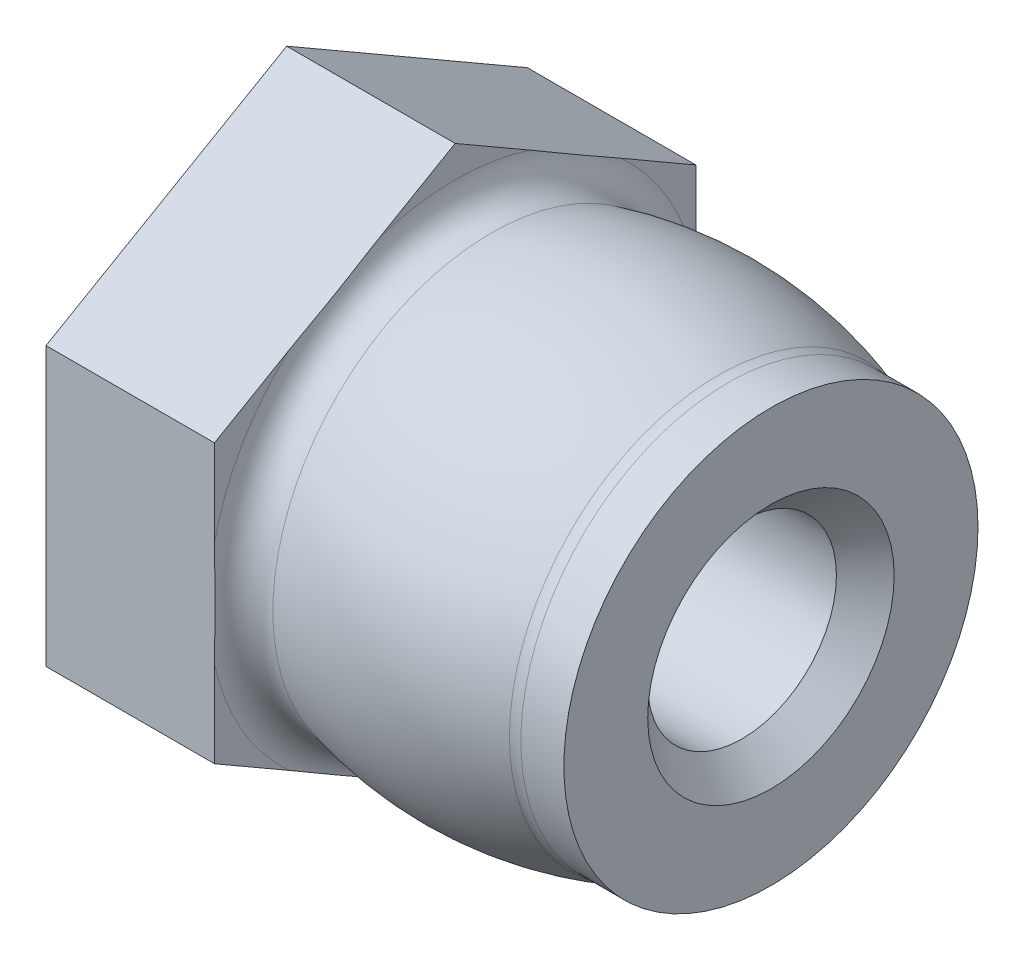
ISO-10303-21;
HEADER;
FILE_DESCRIPTION(('STEP AP214'),'2;1');
FILE_NAME('part.step','',(''),(''),'','','');
FILE_SCHEMA(('AUTOMOTIVE_DESIGN { 1 0 10303 214 1 1 1 1 }'));
ENDSEC;
DATA;
#1=APPLICATION_CONTEXT('core data for automotive mechanical design processes');
#2=APPLICATION_PROTOCOL_DEFINITION('international standard','automotive_design',2000,#1);
#3=PRODUCT_CONTEXT('',#1,'mechanical');
#4=PRODUCT('Part','Part','',(#3));
#5=PRODUCT_RELATED_PRODUCT_CATEGORY('part','',(#4));
#6=PRODUCT_DEFINITION_FORMATION('','',#4);
#7=PRODUCT_DEFINITION_CONTEXT('part definition',#1,'design');
#8=PRODUCT_DEFINITION('design','',#6,#7);
#9=PRODUCT_DEFINITION_SHAPE('','',#8);
#10=(LENGTH_UNIT() NAMED_UNIT(*) SI_UNIT(.MILLI.,.METRE.));
#11=(NAMED_UNIT(*) PLANE_ANGLE_UNIT() SI_UNIT($,.RADIAN.));
#12=(NAMED_UNIT(*) SI_UNIT($,.STERADIAN.) SOLID_ANGLE_UNIT());
#13=UNCERTAINTY_MEASURE_WITH_UNIT(LENGTH_MEASURE(1.E-05),#10,'distance_accuracy_value','');
#14=(GEOMETRIC_REPRESENTATION_CONTEXT(3) GLOBAL_UNCERTAINTY_ASSIGNED_CONTEXT((#13)) GLOBAL_UNIT_ASSIGNED_CONTEXT((#10,
#11,#12)) REPRESENTATION_CONTEXT('',''));
#15=CARTESIAN_POINT('',(0.,0.,0.));
#16=DIRECTION('',(0.,0.,1.));
#17=DIRECTION('',(1.,0.,0.));
#18=AXIS2_PLACEMENT_3D('',#15,#16,#17);
#19=CARTESIAN_POINT('',(-3.14960000000001,0.,0.));
#20=DIRECTION('',(-1.,0.,0.));
#21=DIRECTION('',(0.,0.,1.));
#22=AXIS2_PLACEMENT_3D('',#19,#20,#21);
#23=TOROIDAL_SURFACE('',#22,3.25060987392028,0.381);
#24=CARTESIAN_POINT('',(-3.05302093023256,0.,0.));
#25=DIRECTION('',(1.,0.,0.));
#26=DIRECTION('',(0.,0.,-1.));
#27=AXIS2_PLACEMENT_3D('',#24,#25,#26);
#28=CIRCLE('',#27,2.88205393070018);
#29=CARTESIAN_POINT('',(-3.05302093023256,0.,-2.88205393070018));
#30=VERTEX_POINT('',#29);
#31=EDGE_CURVE('E189',#30,#30,#28,.T.);
#32=ORIENTED_EDGE('',*,*,#31,.F.);
#33=EDGE_LOOP('',(#32));
#34=FACE_BOUND('',#33,.T.);
#35=CARTESIAN_POINT('',(-3.53060000000001,-2.40111969864125,-2.19113868689888));
#36=CARTESIAN_POINT('',(-3.53059778248931,-2.41699539462289,-2.16364117485317));
#37=CARTESIAN_POINT('',(-3.53041782991021,-2.43287055074597,-2.13614459786991));
#38=CARTESIAN_POINT('',(-3.5298255789991,-2.46461936001962,-2.08115404712812));
#39=CARTESIAN_POINT('',(-3.52941328790421,-2.48049301320161,-2.05366007331518));
#40=CARTESIAN_POINT('',(-3.52801246219747,-2.52811586969751,-1.97117486626273));
#41=CARTESIAN_POINT('',(-3.52686002685498,-2.55986366672469,-1.91618606878327));
#42=CARTESIAN_POINT('',(-3.52485740280003,-2.62336235971134,-1.80620310631617));
#43=CARTESIAN_POINT('',(-3.52400721741701,-2.65511325570111,-1.75120894127607));
#44=CARTESIAN_POINT('',(-3.52302462226493,-2.71861636116313,-1.64121833617744));
#45=CARTESIAN_POINT('',(-3.52289216601668,-2.75036857041717,-1.58622189649688));
#46=CARTESIAN_POINT('',(-3.52350562407884,-2.82413679875055,-1.45845157703912));
#47=CARTESIAN_POINT('',(-3.52454938556569,-2.86615200576856,-1.38567910379341));
#48=CARTESIAN_POINT('',(-3.52720055638054,-2.95017441594571,-1.2401480203922));
#49=CARTESIAN_POINT('',(-3.52880793044301,-2.99218161944112,-1.16738940965425));
#50=CARTESIAN_POINT('',(-3.53026428704555,-3.05521473082886,-1.05821285817154));
#51=CARTESIAN_POINT('',(-3.53059056765064,-3.07623699516409,-1.02180122825278));
#52=CARTESIAN_POINT('',(-3.53060905622116,-3.11827879067396,-0.948982702388267));
#53=CARTESIAN_POINT('',(-3.53030136303735,-3.13929832176372,-0.912575806589532));
#54=CARTESIAN_POINT('',(-3.52870070507489,-3.18134771155148,-0.839744127049862));
#55=CARTESIAN_POINT('',(-3.52740694120278,-3.20237756479438,-0.803319352757446));
#56=CARTESIAN_POINT('',(-3.52338294774461,-3.24441366518432,-0.73051069113));
#57=CARTESIAN_POINT('',(-3.52065189611206,-3.26541989192108,-0.694126839146607));
#58=CARTESIAN_POINT('',(-3.5169774328567,-3.28639380282328,-0.657798959830585));
#59=B_SPLINE_CURVE_WITH_KNOTS('',3,(#35,#36,#37,#38,#39,#40,#41,#42,#43,#44,#45,#46,#47,#48,#49,
#50,#51,#52,#53,#54,#55,#56,#57,#58),.UNSPECIFIED.,.F.,.F.,(4,2,2,2,2,2,2,2,2,2,2,4),(0.,
0.0952522088142865,0.190501450772941,0.38101975387857,0.571540155581727,0.762048219287196,
1.01415253280483,1.26624107484074,1.39237544496322,1.51849014939091,1.64470716365326,
1.77099644541574),.UNSPECIFIED.);
#60=CARTESIAN_POINT('',(-3.53060000000001,-2.40111969864125,-2.19113868689888));
#61=VERTEX_POINT('',#60);
#62=CARTESIAN_POINT('',(-3.53060000000001,-3.09814161538993,-0.983861313101117));
#63=VERTEX_POINT('',#62);
#64=EDGE_CURVE('E245',#61,#63,#59,.T.);
#65=ORIENTED_EDGE('',*,*,#64,.F.);
#66=CARTESIAN_POINT('',(-3.53060000000001,0.,0.));
#67=DIRECTION('',(-1.,0.,0.));
#68=DIRECTION('',(0.,0.,1.));
#69=AXIS2_PLACEMENT_3D('',#66,#67,#68);
#70=CIRCLE('',#69,3.25060987392028);
#71=CARTESIAN_POINT('',(-3.53060000000001,-0.697021916748682,-3.175));
#72=VERTEX_POINT('',#71);
#73=EDGE_CURVE('E173',#72,#61,#70,.T.);
#74=ORIENTED_EDGE('',*,*,#73,.F.);
#75=CARTESIAN_POINT('',(-3.53060000000001,0.697021916748679,-3.175));
#76=CARTESIAN_POINT('',(-3.53059778248931,0.665270524785404,-3.175));
#77=CARTESIAN_POINT('',(-3.53041782991021,0.63352021253925,-3.175));
#78=CARTESIAN_POINT('',(-3.5298255789991,0.570022593991937,-3.175));
#79=CARTESIAN_POINT('',(-3.52941328790421,0.538275287627952,-3.175));
#80=CARTESIAN_POINT('',(-3.52801246219747,0.443029574636154,-3.175));
#81=CARTESIAN_POINT('',(-3.52686002685498,0.379533980581803,-3.175));
#82=CARTESIAN_POINT('',(-3.52485740280003,0.252536594608494,-3.175));
#83=CARTESIAN_POINT('',(-3.52400721741701,0.18903480262897,-3.175));
#84=CARTESIAN_POINT('',(-3.52302462226493,0.0620285917049256,-3.175));
#85=CARTESIAN_POINT('',(-3.52289216601668,-0.00147582680316025,-3.175));
#86=CARTESIAN_POINT('',(-3.52350562407884,-0.149012283469925,-3.175));
#87=CARTESIAN_POINT('',(-3.52454938556569,-0.233042697505939,-3.175));
#88=CARTESIAN_POINT('',(-3.52720055638054,-0.401087517860226,-3.175));
#89=CARTESIAN_POINT('',(-3.52880793044301,-0.485101924851065,-3.175));
#90=CARTESIAN_POINT('',(-3.53026428704555,-0.611168147626539,-3.175));
#91=CARTESIAN_POINT('',(-3.53059056765064,-0.653212676296992,-3.175));
#92=CARTESIAN_POINT('',(-3.53060905622116,-0.737296267316729,-3.175));
#93=CARTESIAN_POINT('',(-3.53030136303735,-0.779335329496246,-3.175));
#94=CARTESIAN_POINT('',(-3.52870070507489,-0.863434109071766,-3.175));
#95=CARTESIAN_POINT('',(-3.52740694120278,-0.905493815557562,-3.175));
#96=CARTESIAN_POINT('',(-3.52338294774461,-0.989566016337445,-3.175));
#97=CARTESIAN_POINT('',(-3.52065189611206,-1.03157846981098,-3.175));
#98=CARTESIAN_POINT('',(-3.5169774328567,-1.07352629161537,-3.175));
#99=B_SPLINE_CURVE_WITH_KNOTS('',3,(#75,#76,#77,#78,#79,#80,#81,#82,#83,#84,#85,#86,#87,#88,#89,
#90,#91,#92,#93,#94,#95,#96,#97,#98),.UNSPECIFIED.,.F.,.F.,(4,2,2,2,2,2,2,2,2,2,2,4),(0.,
0.0952522088142865,0.190501450772942,0.38101975387857,0.571540155581726,0.762048219287195,
1.01415253280483,1.26624107484073,1.39237544496321,1.5184901493909,1.64470716365325,
1.77099644541573),.UNSPECIFIED.);
#100=CARTESIAN_POINT('',(-3.53060000000001,0.697021916748679,-3.175));
#101=VERTEX_POINT('',#100);
#102=EDGE_CURVE('E47',#101,#72,#99,.T.);
#103=ORIENTED_EDGE('',*,*,#102,.F.);
#104=CARTESIAN_POINT('',(-3.53060000000001,0.,0.));
#105=DIRECTION('',(-1.,0.,0.));
#106=DIRECTION('',(0.,0.,1.));
#107=AXIS2_PLACEMENT_3D('',#104,#105,#106);
#108=CIRCLE('',#107,3.25060987392028);
#109=CARTESIAN_POINT('',(-3.53060000000001,2.40111969864125,-2.19113868689888));
#110=VERTEX_POINT('',#109);
#111=EDGE_CURVE('E124',#110,#101,#108,.T.);
#112=ORIENTED_EDGE('',*,*,#111,.F.);
#113=CARTESIAN_POINT('',(-3.53060000000001,3.09814161538993,-0.983861313101122));
#114=CARTESIAN_POINT('',(-3.53059778248931,3.08226591940829,-1.01135882514684));
#115=CARTESIAN_POINT('',(-3.53041782991021,3.06639076328522,-1.03885540213009));
#116=CARTESIAN_POINT('',(-3.5298255789991,3.03464195401156,-1.09384595287188));
#117=CARTESIAN_POINT('',(-3.52941328790421,3.01876830082957,-1.12133992668482));
#118=CARTESIAN_POINT('',(-3.52801246219747,2.97114544433367,-1.20382513373728));
#119=CARTESIAN_POINT('',(-3.52686002685498,2.93939764730649,-1.25881393121673));
#120=CARTESIAN_POINT('',(-3.52485740280003,2.87589895431984,-1.36879689368383));
#121=CARTESIAN_POINT('',(-3.52400721741701,2.84414805833008,-1.42379105872394));
#122=CARTESIAN_POINT('',(-3.52302462226493,2.78064495286806,-1.53378166382256));
#123=CARTESIAN_POINT('',(-3.52289216601668,2.74889274361401,-1.58877810350312));
#124=CARTESIAN_POINT('',(-3.52350562407884,2.67512451528063,-1.71654842296088));
#125=CARTESIAN_POINT('',(-3.52454938556569,2.63310930826262,-1.7893208962066));
#126=CARTESIAN_POINT('',(-3.52720055638054,2.54908689808548,-1.9348519796078));
#127=CARTESIAN_POINT('',(-3.52880793044301,2.50707969459006,-2.00761059034575));
#128=CARTESIAN_POINT('',(-3.53026428704555,2.44404658320233,-2.11678714182846));
#129=CARTESIAN_POINT('',(-3.53059056765064,2.4230243188671,-2.15319877174721));
#130=CARTESIAN_POINT('',(-3.53060905622116,2.38098252335723,-2.22601729761172));
#131=CARTESIAN_POINT('',(-3.53030136303735,2.35996299226747,-2.26242419341046));
#132=CARTESIAN_POINT('',(-3.52870070507489,2.31791360247971,-2.33525587295013));
#133=CARTESIAN_POINT('',(-3.52740694120278,2.29688374923682,-2.37168064724254));
#134=CARTESIAN_POINT('',(-3.52338294774461,2.25484764884687,-2.44448930886999));
#135=CARTESIAN_POINT('',(-3.52065189611206,2.23384142211011,-2.48087316085338));
#136=CARTESIAN_POINT('',(-3.5169774328567,2.21286751120791,-2.5172010401694));
#137=B_SPLINE_CURVE_WITH_KNOTS('',3,(#113,#114,#115,#116,#117,#118,#119,#120,#121,#122,#123,
#124,#125,#126,#127,#128,#129,#130,#131,#132,#133,#134,#135,#136),.UNSPECIFIED.,.F.,.F.,(4,2,2,
2,2,2,2,2,2,2,2,4),(0.,0.0952522088142867,0.190501450772942,0.381019753878571,0.571540155581727,
0.762048219287196,1.01415253280482,1.26624107484073,1.39237544496321,1.5184901493909,
1.64470716365324,1.77099644541572),.UNSPECIFIED.);
#138=CARTESIAN_POINT('',(-3.53060000000001,3.09814161538993,-0.983861313101122));
#139=VERTEX_POINT('',#138);
#140=EDGE_CURVE('E136',#139,#110,#137,.T.);
#141=ORIENTED_EDGE('',*,*,#140,.F.);
#142=CARTESIAN_POINT('',(-3.53060000000001,0.,0.));
#143=DIRECTION('',(-1.,0.,0.));
#144=DIRECTION('',(0.,0.,1.));
#145=AXIS2_PLACEMENT_3D('',#142,#143,#144);
#146=CIRCLE('',#145,3.25060987392028);
#147=CARTESIAN_POINT('',(-3.53060000000001,3.09814161538993,0.983861313101121));
#148=VERTEX_POINT('',#147);
#149=EDGE_CURVE('E177',#148,#139,#146,.T.);
#150=ORIENTED_EDGE('',*,*,#149,.F.);
#151=CARTESIAN_POINT('',(-3.53060000000001,2.40111969864125,2.19113868689888));
#152=CARTESIAN_POINT('',(-3.53059778248931,2.41699539462289,2.16364117485316));
#153=CARTESIAN_POINT('',(-3.53041782991021,2.43287055074597,2.13614459786991));
#154=CARTESIAN_POINT('',(-3.5298255789991,2.46461936001962,2.08115404712812));
#155=CARTESIAN_POINT('',(-3.52941328790421,2.48049301320162,2.05366007331518));
#156=CARTESIAN_POINT('',(-3.52801246219747,2.52811586969752,1.97117486626272));
#157=CARTESIAN_POINT('',(-3.52686002685498,2.55986366672469,1.91618606878327));
#158=CARTESIAN_POINT('',(-3.52485740280003,2.62336235971135,1.80620310631617));
#159=CARTESIAN_POINT('',(-3.52400721741701,2.65511325570111,1.75120894127606));
#160=CARTESIAN_POINT('',(-3.52302462226493,2.71861636116313,1.64121833617744));
#161=CARTESIAN_POINT('',(-3.52289216601668,2.75036857041717,1.58622189649688));
#162=CARTESIAN_POINT('',(-3.52350562407884,2.82413679875055,1.45845157703912));
#163=CARTESIAN_POINT('',(-3.52454938556569,2.86615200576856,1.3856791037934));
#164=CARTESIAN_POINT('',(-3.52720055638054,2.9501744159457,1.2401480203922));
#165=CARTESIAN_POINT('',(-3.52880793044301,2.99218161944112,1.16738940965425));
#166=CARTESIAN_POINT('',(-3.53026428704555,3.05521473082886,1.05821285817154));
#167=CARTESIAN_POINT('',(-3.53059056765064,3.07623699516409,1.02180122825279));
#168=CARTESIAN_POINT('',(-3.53060905622116,3.11827879067395,0.948982702388274));
#169=CARTESIAN_POINT('',(-3.53030136303735,3.13929832176371,0.912575806589539));
#170=CARTESIAN_POINT('',(-3.52870070507489,3.18134771155147,0.83974412704987));
#171=CARTESIAN_POINT('',(-3.52740694120278,3.20237756479437,0.803319352757454));
#172=CARTESIAN_POINT('',(-3.52338294774461,3.24441366518431,0.73051069113001));
#173=CARTESIAN_POINT('',(-3.52065189611206,3.26541989192108,0.694126839146617));
#174=CARTESIAN_POINT('',(-3.5169774328567,3.28639380282327,0.657798959830596));
#175=B_SPLINE_CURVE_WITH_KNOTS('',3,(#151,#152,#153,#154,#155,#156,#157,#158,#159,#160,#161,
#162,#163,#164,#165,#166,#167,#168,#169,#170,#171,#172,#173,#174),.UNSPECIFIED.,.F.,.F.,(4,2,2,
2,2,2,2,2,2,2,2,4),(0.,0.0952522088142865,0.190501450772942,0.38101975387857,0.571540155581727,
0.762048219287196,1.01415253280483,1.26624107484073,1.39237544496321,1.5184901493909,
1.64470716365325,1.77099644541572),.UNSPECIFIED.);
#176=CARTESIAN_POINT('',(-3.53060000000001,2.40111969864125,2.19113868689888));
#177=VERTEX_POINT('',#176);
#178=EDGE_CURVE('E229',#177,#148,#175,.T.);
#179=ORIENTED_EDGE('',*,*,#178,.F.);
#180=CARTESIAN_POINT('',(-3.53060000000001,0.,0.));
#181=DIRECTION('',(-1.,0.,0.));
#182=DIRECTION('',(0.,0.,1.));
#183=AXIS2_PLACEMENT_3D('',#180,#181,#182);
#184=CIRCLE('',#183,3.25060987392028);
#185=CARTESIAN_POINT('',(-3.53060000000001,0.697021916748691,3.175));
#186=VERTEX_POINT('',#185);
#187=EDGE_CURVE('E180',#186,#177,#184,.T.);
#188=ORIENTED_EDGE('',*,*,#187,.F.);
#189=CARTESIAN_POINT('',(-3.53060000000001,-0.697021916748688,3.175));
#190=CARTESIAN_POINT('',(-3.53059778248931,-0.665270524785412,3.175));
#191=CARTESIAN_POINT('',(-3.53041782991021,-0.633520212539258,3.175));
#192=CARTESIAN_POINT('',(-3.5298255789991,-0.570022593991945,3.175));
#193=CARTESIAN_POINT('',(-3.52941328790421,-0.538275287627961,3.175));
#194=CARTESIAN_POINT('',(-3.52801246219747,-0.443029574636163,3.175));
#195=CARTESIAN_POINT('',(-3.52686002685498,-0.379533980581812,3.175));
#196=CARTESIAN_POINT('',(-3.52485740280003,-0.252536594608503,3.175));
#197=CARTESIAN_POINT('',(-3.52400721741701,-0.189034802628978,3.175));
#198=CARTESIAN_POINT('',(-3.52302462226493,-0.0620285917049341,3.175));
#199=CARTESIAN_POINT('',(-3.52289216601668,0.00147582680315178,3.175));
#200=CARTESIAN_POINT('',(-3.52350562407884,0.14901228346992,3.175));
#201=CARTESIAN_POINT('',(-3.52454938556569,0.233042697505937,3.175));
#202=CARTESIAN_POINT('',(-3.52720055638054,0.40108751786023,3.175));
#203=CARTESIAN_POINT('',(-3.52880793044301,0.485101924851071,3.175));
#204=CARTESIAN_POINT('',(-3.53026428704555,0.61116814762655,3.175));
#205=CARTESIAN_POINT('',(-3.53059056765064,0.653212676297005,3.175));
#206=CARTESIAN_POINT('',(-3.53060905622116,0.737296267316744,3.175));
#207=CARTESIAN_POINT('',(-3.53030136303735,0.779335329496263,3.175));
#208=CARTESIAN_POINT('',(-3.52870070507489,0.863434109071786,3.175));
#209=CARTESIAN_POINT('',(-3.52740694120278,0.905493815557584,3.175));
#210=CARTESIAN_POINT('',(-3.5233829477446,0.98956601633747,3.175));
#211=CARTESIAN_POINT('',(-3.52065189611205,1.03157846981101,3.175));
#212=CARTESIAN_POINT('',(-3.5169774328567,1.07352629161539,3.175));
#213=B_SPLINE_CURVE_WITH_KNOTS('',3,(#189,#190,#191,#192,#193,#194,#195,#196,#197,#198,#199,
#200,#201,#202,#203,#204,#205,#206,#207,#208,#209,#210,#211,#212),.UNSPECIFIED.,.F.,.F.,(4,2,2,
2,2,2,2,2,2,2,2,4),(0.,0.0952522088142865,0.190501450772942,0.38101975387857,0.571540155581726,
0.762048219287195,1.01415253280484,1.26624107484075,1.39237544496323,1.51849014939093,
1.64470716365329,1.77099644541576),.UNSPECIFIED.);
#214=CARTESIAN_POINT('',(-3.53060000000001,-0.697021916748688,3.175));
#215=VERTEX_POINT('',#214);
#216=EDGE_CURVE('E200',#215,#186,#213,.T.);
#217=ORIENTED_EDGE('',*,*,#216,.F.);
#218=CARTESIAN_POINT('',(-3.53060000000001,0.,0.));
#219=DIRECTION('',(-1.,0.,0.));
#220=DIRECTION('',(0.,0.,1.));
#221=AXIS2_PLACEMENT_3D('',#218,#219,#220);
#222=CIRCLE('',#221,3.25060987392028);
#223=CARTESIAN_POINT('',(-3.53060000000001,-2.40111969864125,2.19113868689888));
#224=VERTEX_POINT('',#223);
#225=EDGE_CURVE('E183',#224,#215,#222,.T.);
#226=ORIENTED_EDGE('',*,*,#225,.F.);
#227=CARTESIAN_POINT('',(-3.53060000000001,-3.09814161538993,0.98386131310112));
#228=CARTESIAN_POINT('',(-3.53059778248931,-3.0822659194083,1.01135882514683));
#229=CARTESIAN_POINT('',(-3.53041782991021,-3.06639076328522,1.03885540213009));
#230=CARTESIAN_POINT('',(-3.5298255789991,-3.03464195401156,1.09384595287188));
#231=CARTESIAN_POINT('',(-3.52941328790421,-3.01876830082957,1.12133992668482));
#232=CARTESIAN_POINT('',(-3.52801246219747,-2.97114544433367,1.20382513373727));
#233=CARTESIAN_POINT('',(-3.52686002685498,-2.9393976473065,1.25881393121673));
#234=CARTESIAN_POINT('',(-3.52485740280003,-2.87589895431984,1.36879689368383));
#235=CARTESIAN_POINT('',(-3.52400721741701,-2.84414805833008,1.42379105872393));
#236=CARTESIAN_POINT('',(-3.52302462226493,-2.78064495286806,1.53378166382256));
#237=CARTESIAN_POINT('',(-3.52289216601668,-2.74889274361401,1.58877810350312));
#238=CARTESIAN_POINT('',(-3.52350562407884,-2.67512451528063,1.71654842296088));
#239=CARTESIAN_POINT('',(-3.52454938556569,-2.63310930826262,1.78932089620659));
#240=CARTESIAN_POINT('',(-3.52720055638054,-2.54908689808548,1.9348519796078));
#241=CARTESIAN_POINT('',(-3.52880793044301,-2.50707969459006,2.00761059034575));
#242=CARTESIAN_POINT('',(-3.53026428704555,-2.44404658320232,2.11678714182846));
#243=CARTESIAN_POINT('',(-3.53059056765064,-2.4230243188671,2.15319877174721));
#244=CARTESIAN_POINT('',(-3.53060905622116,-2.38098252335723,2.22601729761173));
#245=CARTESIAN_POINT('',(-3.53030136303735,-2.35996299226747,2.26242419341046));
#246=CARTESIAN_POINT('',(-3.52870070507489,-2.31791360247971,2.33525587295013));
#247=CARTESIAN_POINT('',(-3.52740694120278,-2.29688374923681,2.37168064724255));
#248=CARTESIAN_POINT('',(-3.52338294774461,-2.25484764884687,2.44448930886999));
#249=CARTESIAN_POINT('',(-3.52065189611206,-2.23384142211011,2.48087316085338));
#250=CARTESIAN_POINT('',(-3.5169774328567,-2.21286751120791,2.51720104016941));
#251=B_SPLINE_CURVE_WITH_KNOTS('',3,(#227,#228,#229,#230,#231,#232,#233,#234,#235,#236,#237,
#238,#239,#240,#241,#242,#243,#244,#245,#246,#247,#248,#249,#250),.UNSPECIFIED.,.F.,.F.,(4,2,2,
2,2,2,2,2,2,2,2,4),(0.,0.0952522088142863,0.190501450772941,0.38101975387857,0.571540155581727,
0.762048219287196,1.01415253280483,1.26624107484073,1.39237544496321,1.5184901493909,
1.64470716365325,1.77099644541572),.UNSPECIFIED.);
#252=CARTESIAN_POINT('',(-3.53060000000001,-3.09814161538993,0.98386131310112));
#253=VERTEX_POINT('',#252);
#254=EDGE_CURVE('E192',#253,#224,#251,.T.);
#255=ORIENTED_EDGE('',*,*,#254,.F.);
#256=CARTESIAN_POINT('',(-3.53060000000001,0.,0.));
#257=DIRECTION('',(-1.,0.,0.));
#258=DIRECTION('',(0.,0.,1.));
#259=AXIS2_PLACEMENT_3D('',#256,#257,#258);
#260=CIRCLE('',#259,3.25060987392028);
#261=EDGE_CURVE('E186',#63,#253,#260,.T.);
#262=ORIENTED_EDGE('',*,*,#261,.F.);
#263=EDGE_LOOP('',(#65,#74,#103,#112,#141,#150,#179,#188,#217,#226,#255,#262));
#264=FACE_BOUND('',#263,.T.);
#265=ADVANCED_FACE('F32',(#34,#264),#23,.F.);
#266=CARTESIAN_POINT('',(-3.53060000000001,3.175,0.));
#267=DIRECTION('',(-1.,0.,0.));
#268=DIRECTION('',(0.,0.,1.));
#269=AXIS2_PLACEMENT_3D('',#266,#267,#268);
#270=PLANE('',#269);
#271=DIRECTION('',(0.,0.5,-0.866025403784439));
#272=VECTOR('',#271,1.);
#273=CARTESIAN_POINT('',(-3.53060000000001,-2.74963065701559,-1.5875));
#274=LINE('',#273,#272);
#275=CARTESIAN_POINT('',(-3.53060000000001,-3.66617420935412,0.));
#276=VERTEX_POINT('',#275);
#277=EDGE_CURVE('E127',#276,#63,#274,.T.);
#278=ORIENTED_EDGE('',*,*,#277,.T.);
#279=ORIENTED_EDGE('',*,*,#261,.T.);
#280=DIRECTION('',(0.,-0.5,-0.866025403784439));
#281=VECTOR('',#280,1.);
#282=CARTESIAN_POINT('',(-3.53060000000001,-2.74963065701559,1.5875));
#283=LINE('',#282,#281);
#284=EDGE_CURVE('E162',#253,#276,#283,.T.);
#285=ORIENTED_EDGE('',*,*,#284,.T.);
#286=EDGE_LOOP('',(#278,#279,#285));
#287=FACE_BOUND('',#286,.T.);
#288=ADVANCED_FACE('F266',(#287),#270,.F.);
#289=CARTESIAN_POINT('',(-3.53060000000001,-1.83308710467706,3.175));
#290=VERTEX_POINT('',#289);
#291=EDGE_CURVE('E163',#290,#224,#283,.T.);
#292=ORIENTED_EDGE('',*,*,#291,.T.);
#293=ORIENTED_EDGE('',*,*,#225,.T.);
#294=DIRECTION('',(0.,-1.,0.));
#295=VECTOR('',#294,1.);
#296=CARTESIAN_POINT('',(-3.53060000000001,0.,3.175));
#297=LINE('',#296,#295);
#298=EDGE_CURVE('E158',#215,#290,#297,.T.);
#299=ORIENTED_EDGE('',*,*,#298,.T.);
#300=EDGE_LOOP('',(#292,#293,#299));
#301=FACE_BOUND('',#300,.T.);
#302=ADVANCED_FACE('F271',(#301),#270,.F.);
#303=CARTESIAN_POINT('',(-3.53060000000001,1.83308710467706,3.175));
#304=VERTEX_POINT('',#303);
#305=EDGE_CURVE('E159',#304,#186,#297,.T.);
#306=ORIENTED_EDGE('',*,*,#305,.T.);
#307=ORIENTED_EDGE('',*,*,#187,.T.);
#308=DIRECTION('',(0.,-0.5,0.866025403784439));
#309=VECTOR('',#308,1.);
#310=CARTESIAN_POINT('',(-3.53060000000001,2.74963065701559,1.5875));
#311=LINE('',#310,#309);
#312=EDGE_CURVE('E137',#177,#304,#311,.T.);
#313=ORIENTED_EDGE('',*,*,#312,.T.);
#314=EDGE_LOOP('',(#306,#307,#313));
#315=FACE_BOUND('',#314,.T.);
#316=ADVANCED_FACE('F323',(#315),#270,.F.);
#317=CARTESIAN_POINT('',(-3.53060000000001,3.66617420935412,0.));
#318=VERTEX_POINT('',#317);
#319=EDGE_CURVE('E155',#318,#148,#311,.T.);
#320=ORIENTED_EDGE('',*,*,#319,.T.);
#321=ORIENTED_EDGE('',*,*,#149,.T.);
#322=DIRECTION('',(0.,0.5,0.866025403784438));
#323=VECTOR('',#322,1.);
#324=CARTESIAN_POINT('',(-3.53060000000001,2.74963065701559,-1.5875));
#325=LINE('',#324,#323);
#326=EDGE_CURVE('E138',#139,#318,#325,.T.);
#327=ORIENTED_EDGE('',*,*,#326,.T.);
#328=EDGE_LOOP('',(#320,#321,#327));
#329=FACE_BOUND('',#328,.T.);
#330=ADVANCED_FACE('F307',(#329),#270,.F.);
#331=CARTESIAN_POINT('',(-3.53060000000001,1.83308710467706,-3.175));
#332=VERTEX_POINT('',#331);
#333=EDGE_CURVE('E123',#332,#110,#325,.T.);
#334=ORIENTED_EDGE('',*,*,#333,.T.);
#335=ORIENTED_EDGE('',*,*,#111,.T.);
#336=DIRECTION('',(0.,1.,0.));
#337=VECTOR('',#336,1.);
#338=CARTESIAN_POINT('',(-3.53060000000001,0.,-3.175));
#339=LINE('',#338,#337);
#340=EDGE_CURVE('E120',#101,#332,#339,.T.);
#341=ORIENTED_EDGE('',*,*,#340,.T.);
#342=EDGE_LOOP('',(#334,#335,#341));
#343=FACE_BOUND('',#342,.T.);
#344=ADVANCED_FACE('F122',(#343),#270,.F.);
#345=CARTESIAN_POINT('',(-1.7653,0.,0.));
#346=DIRECTION('',(-1.,0.,0.));
#347=DIRECTION('',(0.,0.,1.));
#348=AXIS2_PLACEMENT_3D('',#345,#346,#347);
#349=DEGENERATE_TOROIDAL_SURFACE('',#348,2.03202531223445,5.08,.F.);
#350=CARTESIAN_POINT('',(-0.0607843458594306,0.,0.));
#351=DIRECTION('',(-1.,0.,0.));
#352=DIRECTION('',(0.,0.,1.));
#353=AXIS2_PLACEMENT_3D('',#350,#351,#352);
#354=CIRCLE('',#353,2.75347637356504);
#355=CARTESIAN_POINT('',(-0.0607843458594306,0.,2.75347637356504));
#356=VERTEX_POINT('',#355);
#357=EDGE_CURVE('E346',#356,#356,#354,.T.);
#358=ORIENTED_EDGE('',*,*,#357,.T.);
#359=EDGE_LOOP('',(#358));
#360=FACE_BOUND('',#359,.T.);
#361=ORIENTED_EDGE('',*,*,#31,.T.);
#362=EDGE_LOOP('',(#361));
#363=FACE_BOUND('',#362,.T.);
#364=ADVANCED_FACE('F336',(#360,#363),#349,.F.);
#365=CARTESIAN_POINT('',(-40.930080616584,0.,0.));
#366=DIRECTION('',(-1.,0.,0.));
#367=DIRECTION('',(0.,0.,1.));
#368=AXIS2_PLACEMENT_3D('',#365,#366,#367);
#369=CYLINDRICAL_SURFACE('',#368,1.2446);
#370=CARTESIAN_POINT('',(0.253999999999997,0.,0.));
#371=DIRECTION('',(1.,0.,0.));
#372=DIRECTION('',(0.,0.,-1.));
#373=AXIS2_PLACEMENT_3D('',#370,#371,#372);
#374=CIRCLE('',#373,1.2446);
#375=CARTESIAN_POINT('',(0.253999999999997,0.,-1.2446));
#376=VERTEX_POINT('',#375);
#377=EDGE_CURVE('E40',#376,#376,#374,.T.);
#378=ORIENTED_EDGE('',*,*,#377,.T.);
#379=EDGE_LOOP('',(#378));
#380=FACE_BOUND('',#379,.T.);
#381=CARTESIAN_POINT('',(-5.7531,0.,0.));
#382=DIRECTION('',(-1.,0.,0.));
#383=DIRECTION('',(0.,0.,1.));
#384=AXIS2_PLACEMENT_3D('',#381,#382,#383);
#385=CIRCLE('',#384,1.2446);
#386=CARTESIAN_POINT('',(-5.7531,0.,1.2446));
#387=VERTEX_POINT('',#386);
#388=EDGE_CURVE('E170',#387,#387,#385,.T.);
#389=ORIENTED_EDGE('',*,*,#388,.T.);
#390=EDGE_LOOP('',(#389));
#391=FACE_BOUND('',#390,.T.);
#392=ADVANCED_FACE('F333',(#380,#391),#369,.F.);
#393=CARTESIAN_POINT('',(-5.75310000000001,1.2446,0.));
#394=DIRECTION('',(1.,0.,0.));
#395=DIRECTION('',(0.,0.,-1.));
#396=AXIS2_PLACEMENT_3D('',#393,#394,#395);
#397=PLANE('',#396);
#398=ORIENTED_EDGE('',*,*,#388,.F.);
#399=EDGE_LOOP('',(#398));
#400=FACE_BOUND('',#399,.T.);
#401=DIRECTION('',(0.,0.5,0.866025403784439));
#402=VECTOR('',#401,1.);
#403=CARTESIAN_POINT('',(-5.75310000000001,-2.74963065701559,1.5875));
#404=LINE('',#403,#402);
#405=CARTESIAN_POINT('',(-5.75310000000001,-3.66617420935412,0.));
#406=VERTEX_POINT('',#405);
#407=CARTESIAN_POINT('',(-5.75310000000001,-1.83308710467706,3.175));
#408=VERTEX_POINT('',#407);
#409=EDGE_CURVE('E298',#406,#408,#404,.T.);
#410=ORIENTED_EDGE('',*,*,#409,.T.);
#411=DIRECTION('',(0.,1.,0.));
#412=VECTOR('',#411,1.);
#413=CARTESIAN_POINT('',(-5.75310000000001,0.,3.175));
#414=LINE('',#413,#412);
#415=CARTESIAN_POINT('',(-5.75310000000001,1.83308710467706,3.175));
#416=VERTEX_POINT('',#415);
#417=EDGE_CURVE('E300',#408,#416,#414,.T.);
#418=ORIENTED_EDGE('',*,*,#417,.T.);
#419=DIRECTION('',(0.,0.5,-0.866025403784439));
#420=VECTOR('',#419,1.);
#421=CARTESIAN_POINT('',(-5.75310000000001,2.74963065701559,1.5875));
#422=LINE('',#421,#420);
#423=CARTESIAN_POINT('',(-5.75310000000001,3.66617420935412,0.));
#424=VERTEX_POINT('',#423);
#425=EDGE_CURVE('E302',#416,#424,#422,.T.);
#426=ORIENTED_EDGE('',*,*,#425,.T.);
#427=DIRECTION('',(0.,-0.5,-0.866025403784439));
#428=VECTOR('',#427,1.);
#429=CARTESIAN_POINT('',(-5.75310000000001,2.74963065701559,-1.5875));
#430=LINE('',#429,#428);
#431=CARTESIAN_POINT('',(-5.75310000000001,1.83308710467706,-3.175));
#432=VERTEX_POINT('',#431);
#433=EDGE_CURVE('E285',#424,#432,#430,.T.);
#434=ORIENTED_EDGE('',*,*,#433,.T.);
#435=DIRECTION('',(0.,-1.,0.));
#436=VECTOR('',#435,1.);
#437=CARTESIAN_POINT('',(-5.75310000000001,0.,-3.175));
#438=LINE('',#437,#436);
#439=CARTESIAN_POINT('',(-5.75310000000001,-1.83308710467706,-3.175));
#440=VERTEX_POINT('',#439);
#441=EDGE_CURVE('E142',#432,#440,#438,.T.);
#442=ORIENTED_EDGE('',*,*,#441,.T.);
#443=DIRECTION('',(0.,-0.5,0.866025403784439));
#444=VECTOR('',#443,1.);
#445=CARTESIAN_POINT('',(-5.75310000000001,-2.74963065701559,-1.5875));
#446=LINE('',#445,#444);
#447=EDGE_CURVE('E284',#440,#406,#446,.T.);
#448=ORIENTED_EDGE('',*,*,#447,.T.);
#449=EDGE_LOOP('',(#410,#418,#426,#434,#442,#448));
#450=FACE_BOUND('',#449,.T.);
#451=ADVANCED_FACE('F311',(#400,#450),#397,.F.);
#452=CARTESIAN_POINT('',(-3.53060000000001,-1.83308710467706,-3.175));
#453=VERTEX_POINT('',#452);
#454=EDGE_CURVE('E126',#453,#72,#339,.T.);
#455=ORIENTED_EDGE('',*,*,#454,.T.);
#456=ORIENTED_EDGE('',*,*,#73,.T.);
#457=EDGE_CURVE('E166',#61,#453,#274,.T.);
#458=ORIENTED_EDGE('',*,*,#457,.T.);
#459=EDGE_LOOP('',(#455,#456,#458));
#460=FACE_BOUND('',#459,.T.);
#461=ADVANCED_FACE('F273',(#460),#270,.F.);
#462=CARTESIAN_POINT('',(6.16918522098986,2.74963065701559,-1.5875));
#463=DIRECTION('',(0.,0.866025403784439,-0.5));
#464=DIRECTION('',(0.,0.5,0.866025403784438));
#465=AXIS2_PLACEMENT_3D('',#462,#463,#464);
#466=PLANE('',#465);
#467=DIRECTION('',(-1.,0.,0.));
#468=VECTOR('',#467,1.);
#469=CARTESIAN_POINT('',(6.16918522098986,1.83308710467706,-3.175));
#470=LINE('',#469,#468);
#471=EDGE_CURVE('E133',#332,#432,#470,.T.);
#472=ORIENTED_EDGE('',*,*,#471,.T.);
#473=ORIENTED_EDGE('',*,*,#433,.F.);
#474=DIRECTION('',(-1.,0.,0.));
#475=VECTOR('',#474,1.);
#476=CARTESIAN_POINT('',(6.16918522098986,3.66617420935412,0.));
#477=LINE('',#476,#475);
#478=EDGE_CURVE('E143',#318,#424,#477,.T.);
#479=ORIENTED_EDGE('',*,*,#478,.F.);
#480=ORIENTED_EDGE('',*,*,#326,.F.);
#481=ORIENTED_EDGE('',*,*,#140,.T.);
#482=ORIENTED_EDGE('',*,*,#333,.F.);
#483=EDGE_LOOP('',(#472,#473,#479,#480,#481,#482));
#484=FACE_BOUND('',#483,.T.);
#485=ADVANCED_FACE('F131',(#484),#466,.T.);
#486=CARTESIAN_POINT('',(6.16918522098986,2.74963065701559,1.5875));
#487=DIRECTION('',(0.,0.866025403784439,0.5));
#488=DIRECTION('',(0.,-0.5,0.866025403784439));
#489=AXIS2_PLACEMENT_3D('',#486,#487,#488);
#490=PLANE('',#489);
#491=ORIENTED_EDGE('',*,*,#478,.T.);
#492=ORIENTED_EDGE('',*,*,#425,.F.);
#493=DIRECTION('',(-1.,0.,0.));
#494=VECTOR('',#493,1.);
#495=CARTESIAN_POINT('',(6.16918522098986,1.83308710467706,3.175));
#496=LINE('',#495,#494);
#497=EDGE_CURVE('E147',#304,#416,#496,.T.);
#498=ORIENTED_EDGE('',*,*,#497,.F.);
#499=ORIENTED_EDGE('',*,*,#312,.F.);
#500=ORIENTED_EDGE('',*,*,#178,.T.);
#501=ORIENTED_EDGE('',*,*,#319,.F.);
#502=EDGE_LOOP('',(#491,#492,#498,#499,#500,#501));
#503=FACE_BOUND('',#502,.T.);
#504=ADVANCED_FACE('F221',(#503),#490,.T.);
#505=CARTESIAN_POINT('',(6.16918522098986,0.,3.175));
#506=DIRECTION('',(0.,0.,1.));
#507=DIRECTION('',(0.,-1.,0.));
#508=AXIS2_PLACEMENT_3D('',#505,#506,#507);
#509=PLANE('',#508);
#510=ORIENTED_EDGE('',*,*,#417,.F.);
#511=DIRECTION('',(-1.,0.,0.));
#512=VECTOR('',#511,1.);
#513=CARTESIAN_POINT('',(6.16918522098986,-1.83308710467706,3.175));
#514=LINE('',#513,#512);
#515=EDGE_CURVE('E288',#290,#408,#514,.T.);
#516=ORIENTED_EDGE('',*,*,#515,.F.);
#517=ORIENTED_EDGE('',*,*,#298,.F.);
#518=ORIENTED_EDGE('',*,*,#216,.T.);
#519=ORIENTED_EDGE('',*,*,#305,.F.);
#520=ORIENTED_EDGE('',*,*,#497,.T.);
#521=EDGE_LOOP('',(#510,#516,#517,#518,#519,#520));
#522=FACE_BOUND('',#521,.T.);
#523=ADVANCED_FACE('F214',(#522),#509,.T.);
#524=CARTESIAN_POINT('',(6.16918522098986,-2.74963065701559,1.5875));
#525=DIRECTION('',(0.,-0.866025403784439,0.5));
#526=DIRECTION('',(0.,-0.5,-0.866025403784439));
#527=AXIS2_PLACEMENT_3D('',#524,#525,#526);
#528=PLANE('',#527);
#529=ORIENTED_EDGE('',*,*,#515,.T.);
#530=ORIENTED_EDGE('',*,*,#409,.F.);
#531=DIRECTION('',(-1.,0.,0.));
#532=VECTOR('',#531,1.);
#533=CARTESIAN_POINT('',(6.16918522098986,-3.66617420935412,0.));
#534=LINE('',#533,#532);
#535=EDGE_CURVE('E286',#276,#406,#534,.T.);
#536=ORIENTED_EDGE('',*,*,#535,.F.);
#537=ORIENTED_EDGE('',*,*,#284,.F.);
#538=ORIENTED_EDGE('',*,*,#254,.T.);
#539=ORIENTED_EDGE('',*,*,#291,.F.);
#540=EDGE_LOOP('',(#529,#530,#536,#537,#538,#539));
#541=FACE_BOUND('',#540,.T.);
#542=ADVANCED_FACE('F209',(#541),#528,.T.);
#543=CARTESIAN_POINT('',(6.16918522098986,-2.74963065701559,-1.5875));
#544=DIRECTION('',(0.,-0.866025403784439,-0.5));
#545=DIRECTION('',(0.,0.5,-0.866025403784439));
#546=AXIS2_PLACEMENT_3D('',#543,#544,#545);
#547=PLANE('',#546);
#548=ORIENTED_EDGE('',*,*,#535,.T.);
#549=ORIENTED_EDGE('',*,*,#447,.F.);
#550=DIRECTION('',(-1.,0.,0.));
#551=VECTOR('',#550,1.);
#552=CARTESIAN_POINT('',(6.16918522098986,-1.83308710467706,-3.175));
#553=LINE('',#552,#551);
#554=EDGE_CURVE('E152',#453,#440,#553,.T.);
#555=ORIENTED_EDGE('',*,*,#554,.F.);
#556=ORIENTED_EDGE('',*,*,#457,.F.);
#557=ORIENTED_EDGE('',*,*,#64,.T.);
#558=ORIENTED_EDGE('',*,*,#277,.F.);
#559=EDGE_LOOP('',(#548,#549,#555,#556,#557,#558));
#560=FACE_BOUND('',#559,.T.);
#561=ADVANCED_FACE('F213',(#560),#547,.T.);
#562=CARTESIAN_POINT('',(6.16918522098986,0.,-3.175));
#563=DIRECTION('',(0.,0.,-1.));
#564=DIRECTION('',(0.,1.,0.));
#565=AXIS2_PLACEMENT_3D('',#562,#563,#564);
#566=PLANE('',#565);
#567=ORIENTED_EDGE('',*,*,#554,.T.);
#568=ORIENTED_EDGE('',*,*,#441,.F.);
#569=ORIENTED_EDGE('',*,*,#471,.F.);
#570=ORIENTED_EDGE('',*,*,#340,.F.);
#571=ORIENTED_EDGE('',*,*,#102,.T.);
#572=ORIENTED_EDGE('',*,*,#454,.F.);
#573=EDGE_LOOP('',(#567,#568,#569,#570,#571,#572));
#574=FACE_BOUND('',#573,.T.);
#575=ADVANCED_FACE('F141',(#574),#566,.T.);
#576=CARTESIAN_POINT('',(0.635,0.,0.));
#577=DIRECTION('',(1.,0.,0.));
#578=DIRECTION('',(0.,0.,-1.));
#579=AXIS2_PLACEMENT_3D('',#576,#577,#578);
#580=PLANE('',#579);
#581=CARTESIAN_POINT('',(0.635,0.,0.));
#582=DIRECTION('',(1.,0.,0.));
#583=DIRECTION('',(0.,0.,-1.));
#584=AXIS2_PLACEMENT_3D('',#581,#582,#583);
#585=CIRCLE('',#584,1.6256);
#586=CARTESIAN_POINT('',(0.635,0.,-1.6256));
#587=VERTEX_POINT('',#586);
#588=EDGE_CURVE('E11',#587,#587,#585,.F.);
#589=ORIENTED_EDGE('',*,*,#588,.T.);
#590=EDGE_LOOP('',(#589));
#591=FACE_BOUND('',#590,.T.);
#592=CARTESIAN_POINT('',(0.635,0.,0.));
#593=DIRECTION('',(1.,0.,0.));
#594=DIRECTION('',(0.,0.,-1.));
#595=AXIS2_PLACEMENT_3D('',#592,#593,#594);
#596=CIRCLE('',#595,2.731389);
#597=CARTESIAN_POINT('',(0.635,0.,-2.731389));
#598=VERTEX_POINT('',#597);
#599=EDGE_CURVE('E144',#598,#598,#596,.T.);
#600=ORIENTED_EDGE('',*,*,#599,.T.);
#601=EDGE_LOOP('',(#600));
#602=FACE_BOUND('',#601,.T.);
#603=ADVANCED_FACE('F254',(#591,#602),#580,.T.);
#604=CARTESIAN_POINT('',(0.635,0.,0.));
#605=DIRECTION('',(-1.,0.,0.));
#606=DIRECTION('',(0.,0.,1.));
#607=AXIS2_PLACEMENT_3D('',#604,#605,#606);
#608=CYLINDRICAL_SURFACE('',#607,2.731389);
#609=CARTESIAN_POINT('',(0.0670543282011125,0.,0.));
#610=DIRECTION('',(1.,0.,0.));
#611=DIRECTION('',(0.,0.,-1.));
#612=AXIS2_PLACEMENT_3D('',#609,#610,#611);
#613=CIRCLE('',#612,2.731389);
#614=CARTESIAN_POINT('',(0.0670543282011125,0.,-2.731389));
#615=VERTEX_POINT('',#614);
#616=EDGE_CURVE('E279',#615,#615,#613,.T.);
#617=ORIENTED_EDGE('',*,*,#616,.T.);
#618=EDGE_LOOP('',(#617));
#619=FACE_BOUND('',#618,.T.);
#620=ORIENTED_EDGE('',*,*,#599,.F.);
#621=EDGE_LOOP('',(#620));
#622=FACE_BOUND('',#621,.T.);
#623=ADVANCED_FACE('F255',(#619,#622),#608,.T.);
#624=CARTESIAN_POINT('',(0.0670543282011125,0.,0.));
#625=DIRECTION('',(1.,0.,0.));
#626=DIRECTION('',(0.,0.,-1.));
#627=AXIS2_PLACEMENT_3D('',#624,#625,#626);
#628=TOROIDAL_SURFACE('',#627,3.112389,0.381);
#629=ORIENTED_EDGE('',*,*,#357,.F.);
#630=EDGE_LOOP('',(#629));
#631=FACE_BOUND('',#630,.T.);
#632=ORIENTED_EDGE('',*,*,#616,.F.);
#633=EDGE_LOOP('',(#632));
#634=FACE_BOUND('',#633,.T.);
#635=ADVANCED_FACE('F258',(#631,#634),#628,.F.);
#636=CARTESIAN_POINT('',(0.253999999999997,0.,0.));
#637=DIRECTION('',(1.,0.,0.));
#638=DIRECTION('',(0.,0.,-1.));
#639=AXIS2_PLACEMENT_3D('',#636,#637,#638);
#640=CONICAL_SURFACE('',#639,1.2446,0.785398163397451);
#641=ORIENTED_EDGE('',*,*,#588,.F.);
#642=EDGE_LOOP('',(#641));
#643=FACE_BOUND('',#642,.T.);
#644=ORIENTED_EDGE('',*,*,#377,.F.);
#645=EDGE_LOOP('',(#644));
#646=FACE_BOUND('',#645,.T.);
#647=ADVANCED_FACE('F34',(#643,#646),#640,.F.);
#648=CLOSED_SHELL('',(#265,#288,#302,#316,#330,#344,#364,#392,#451,#461,#485,#504,#523,#542,
#561,#575,#603,#623,#635,#647));
#649=MANIFOLD_SOLID_BREP('B2',#648);
#650=ADVANCED_BREP_SHAPE_REPRESENTATION('',(#18,#649),#14);
#651=SHAPE_DEFINITION_REPRESENTATION(#9,#650);
ENDSEC;
END-ISO-10303-21;
